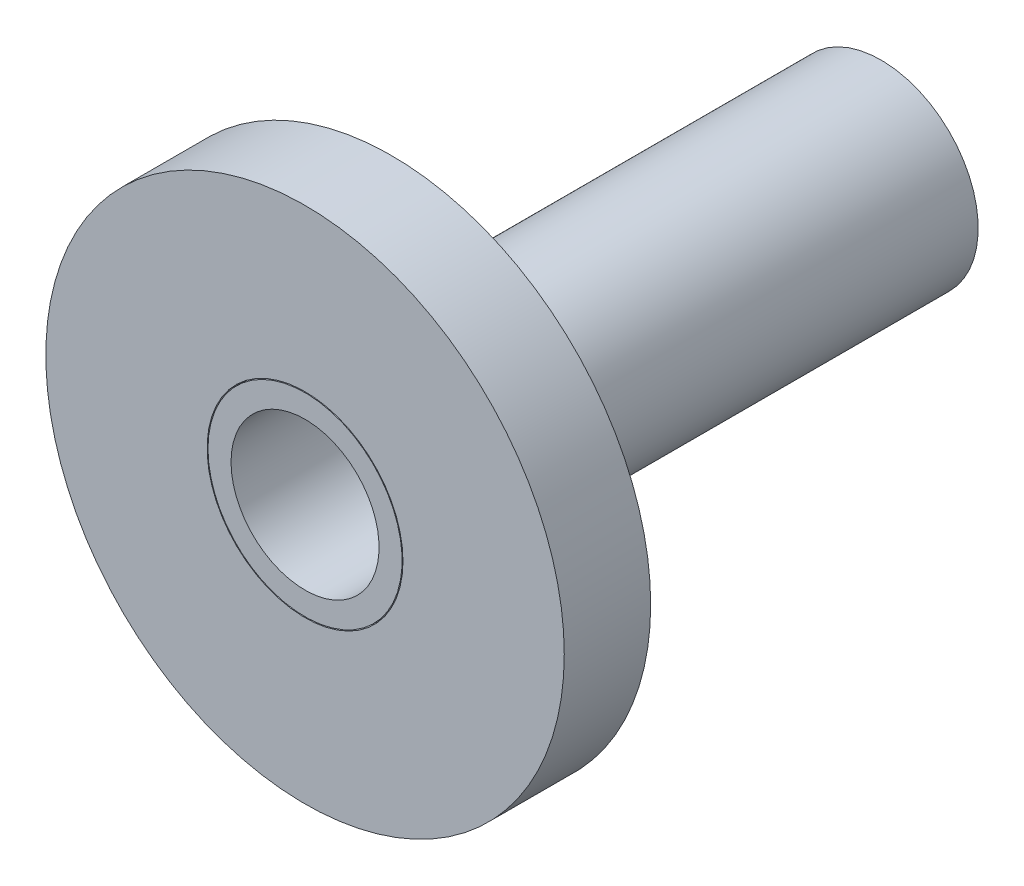
ISO-10303-21;
HEADER;
FILE_DESCRIPTION(('STEP AP214'),'2;1');
FILE_NAME('part.step','',(''),(''),'','','');
FILE_SCHEMA(('AUTOMOTIVE_DESIGN { 1 0 10303 214 1 1 1 1 }'));
ENDSEC;
DATA;
#1=APPLICATION_CONTEXT('core data for automotive mechanical design processes');
#2=APPLICATION_PROTOCOL_DEFINITION('international standard','automotive_design',2000,#1);
#3=PRODUCT_CONTEXT('',#1,'mechanical');
#4=PRODUCT('Part','Part','',(#3));
#5=PRODUCT_RELATED_PRODUCT_CATEGORY('part','',(#4));
#6=PRODUCT_DEFINITION_FORMATION('','',#4);
#7=PRODUCT_DEFINITION_CONTEXT('part definition',#1,'design');
#8=PRODUCT_DEFINITION('design','',#6,#7);
#9=PRODUCT_DEFINITION_SHAPE('','',#8);
#10=(LENGTH_UNIT() NAMED_UNIT(*) SI_UNIT(.MILLI.,.METRE.));
#11=(NAMED_UNIT(*) PLANE_ANGLE_UNIT() SI_UNIT($,.RADIAN.));
#12=(NAMED_UNIT(*) SI_UNIT($,.STERADIAN.) SOLID_ANGLE_UNIT());
#13=UNCERTAINTY_MEASURE_WITH_UNIT(LENGTH_MEASURE(1.E-05),#10,'distance_accuracy_value','');
#14=(GEOMETRIC_REPRESENTATION_CONTEXT(3) GLOBAL_UNCERTAINTY_ASSIGNED_CONTEXT((#13)) GLOBAL_UNIT_ASSIGNED_CONTEXT((#10,
#11,#12)) REPRESENTATION_CONTEXT('',''));
#15=CARTESIAN_POINT('',(0.,0.,0.));
#16=DIRECTION('',(0.,0.,1.));
#17=DIRECTION('',(1.,0.,0.));
#18=AXIS2_PLACEMENT_3D('',#15,#16,#17);
#19=CARTESIAN_POINT('',(0.,0.,-15.));
#20=DIRECTION('',(0.,0.,1.));
#21=DIRECTION('',(1.,0.,0.));
#22=AXIS2_PLACEMENT_3D('',#19,#20,#21);
#23=CYLINDRICAL_SURFACE('',#22,45.);
#24=CARTESIAN_POINT('',(0.,0.,-15.));
#25=DIRECTION('',(0.,0.,1.));
#26=DIRECTION('',(1.,0.,0.));
#27=AXIS2_PLACEMENT_3D('',#24,#25,#26);
#28=CIRCLE('',#27,45.);
#29=CARTESIAN_POINT('',(45.,0.,-15.));
#30=VERTEX_POINT('',#29);
#31=EDGE_CURVE('E14',#30,#30,#28,.T.);
#32=ORIENTED_EDGE('',*,*,#31,.T.);
#33=EDGE_LOOP('',(#32));
#34=FACE_BOUND('',#33,.T.);
#35=CARTESIAN_POINT('',(0.,0.,0.));
#36=DIRECTION('',(0.,0.,1.));
#37=DIRECTION('',(1.,0.,0.));
#38=AXIS2_PLACEMENT_3D('',#35,#36,#37);
#39=CIRCLE('',#38,45.);
#40=CARTESIAN_POINT('',(45.,0.,0.));
#41=VERTEX_POINT('',#40);
#42=EDGE_CURVE('E64',#41,#41,#39,.T.);
#43=ORIENTED_EDGE('',*,*,#42,.F.);
#44=EDGE_LOOP('',(#43));
#45=FACE_BOUND('',#44,.T.);
#46=ADVANCED_FACE('F61',(#34,#45),#23,.T.);
#47=CARTESIAN_POINT('',(0.,0.,-15.));
#48=DIRECTION('',(0.,0.,1.));
#49=DIRECTION('',(1.,0.,0.));
#50=AXIS2_PLACEMENT_3D('',#47,#48,#49);
#51=PLANE('',#50);
#52=CARTESIAN_POINT('',(0.,0.,-15.));
#53=DIRECTION('',(0.,0.,1.));
#54=DIRECTION('',(1.,0.,0.));
#55=AXIS2_PLACEMENT_3D('',#52,#53,#54);
#56=CIRCLE('',#55,17.);
#57=CARTESIAN_POINT('',(17.,0.,-15.));
#58=VERTEX_POINT('',#57);
#59=EDGE_CURVE('E71',#58,#58,#56,.T.);
#60=ORIENTED_EDGE('',*,*,#59,.T.);
#61=EDGE_LOOP('',(#60));
#62=FACE_BOUND('',#61,.T.);
#63=ORIENTED_EDGE('',*,*,#31,.F.);
#64=EDGE_LOOP('',(#63));
#65=FACE_BOUND('',#64,.T.);
#66=ADVANCED_FACE('F79',(#62,#65),#51,.F.);
#67=CARTESIAN_POINT('',(0.,0.,0.));
#68=DIRECTION('',(0.,0.,1.));
#69=DIRECTION('',(1.,0.,0.));
#70=AXIS2_PLACEMENT_3D('',#67,#68,#69);
#71=PLANE('',#70);
#72=CARTESIAN_POINT('',(0.,0.,0.));
#73=DIRECTION('',(0.,0.,1.));
#74=DIRECTION('',(1.,0.,0.));
#75=AXIS2_PLACEMENT_3D('',#72,#73,#74);
#76=CIRCLE('',#75,17.);
#77=CARTESIAN_POINT('',(17.,0.,0.));
#78=VERTEX_POINT('',#77);
#79=EDGE_CURVE('E73',#78,#78,#76,.T.);
#80=ORIENTED_EDGE('',*,*,#79,.F.);
#81=EDGE_LOOP('',(#80));
#82=FACE_BOUND('',#81,.T.);
#83=ORIENTED_EDGE('',*,*,#42,.T.);
#84=EDGE_LOOP('',(#83));
#85=FACE_BOUND('',#84,.T.);
#86=ADVANCED_FACE('F85',(#82,#85),#71,.T.);
#87=CARTESIAN_POINT('',(0.,0.,-15.));
#88=DIRECTION('',(0.,0.,1.));
#89=DIRECTION('',(1.,0.,0.));
#90=AXIS2_PLACEMENT_3D('',#87,#88,#89);
#91=CYLINDRICAL_SURFACE('',#90,17.);
#92=ORIENTED_EDGE('',*,*,#59,.F.);
#93=EDGE_LOOP('',(#92));
#94=FACE_BOUND('',#93,.T.);
#95=ORIENTED_EDGE('',*,*,#79,.T.);
#96=EDGE_LOOP('',(#95));
#97=FACE_BOUND('',#96,.T.);
#98=ADVANCED_FACE('F82',(#94,#97),#91,.F.);
#99=CLOSED_SHELL('',(#46,#66,#86,#98));
#100=MANIFOLD_SOLID_BREP('B2',#99);
#101=CARTESIAN_POINT('',(0.,0.,-100.));
#102=DIRECTION('',(0.,0.,1.));
#103=DIRECTION('',(1.,0.,0.));
#104=AXIS2_PLACEMENT_3D('',#101,#102,#103);
#105=CYLINDRICAL_SURFACE('',#104,12.85);
#106=CARTESIAN_POINT('',(0.,0.,-100.));
#107=DIRECTION('',(0.,0.,-1.));
#108=DIRECTION('',(-1.,0.,0.));
#109=AXIS2_PLACEMENT_3D('',#106,#107,#108);
#110=CIRCLE('',#109,12.85);
#111=CARTESIAN_POINT('',(-12.85,0.,-100.));
#112=VERTEX_POINT('',#111);
#113=EDGE_CURVE('E136',#112,#112,#110,.T.);
#114=ORIENTED_EDGE('',*,*,#113,.T.);
#115=EDGE_LOOP('',(#114));
#116=FACE_BOUND('',#115,.T.);
#117=CARTESIAN_POINT('',(0.,0.,0.));
#118=DIRECTION('',(0.,0.,-1.));
#119=DIRECTION('',(-1.,0.,0.));
#120=AXIS2_PLACEMENT_3D('',#117,#118,#119);
#121=CIRCLE('',#120,12.85);
#122=CARTESIAN_POINT('',(-12.85,0.,0.));
#123=VERTEX_POINT('',#122);
#124=EDGE_CURVE('E142',#123,#123,#121,.T.);
#125=ORIENTED_EDGE('',*,*,#124,.F.);
#126=EDGE_LOOP('',(#125));
#127=FACE_BOUND('',#126,.T.);
#128=ADVANCED_FACE('F129',(#116,#127),#105,.F.);
#129=CARTESIAN_POINT('',(0.,0.,-100.));
#130=DIRECTION('',(0.,0.,1.));
#131=DIRECTION('',(1.,0.,0.));
#132=AXIS2_PLACEMENT_3D('',#129,#130,#131);
#133=CYLINDRICAL_SURFACE('',#132,16.85);
#134=CARTESIAN_POINT('',(0.,0.,-100.));
#135=DIRECTION('',(0.,0.,-1.));
#136=DIRECTION('',(-1.,0.,0.));
#137=AXIS2_PLACEMENT_3D('',#134,#135,#136);
#138=CIRCLE('',#137,16.85);
#139=CARTESIAN_POINT('',(-16.85,0.,-100.));
#140=VERTEX_POINT('',#139);
#141=EDGE_CURVE('E60',#140,#140,#138,.T.);
#142=ORIENTED_EDGE('',*,*,#141,.F.);
#143=EDGE_LOOP('',(#142));
#144=FACE_BOUND('',#143,.T.);
#145=CARTESIAN_POINT('',(0.,0.,0.));
#146=DIRECTION('',(0.,0.,-1.));
#147=DIRECTION('',(-1.,0.,0.));
#148=AXIS2_PLACEMENT_3D('',#145,#146,#147);
#149=CIRCLE('',#148,16.85);
#150=CARTESIAN_POINT('',(-16.85,0.,0.));
#151=VERTEX_POINT('',#150);
#152=EDGE_CURVE('E132',#151,#151,#149,.T.);
#153=ORIENTED_EDGE('',*,*,#152,.T.);
#154=EDGE_LOOP('',(#153));
#155=FACE_BOUND('',#154,.T.);
#156=ADVANCED_FACE('F149',(#144,#155),#133,.T.);
#157=CARTESIAN_POINT('',(0.,0.,-100.));
#158=DIRECTION('',(0.,0.,-1.));
#159=DIRECTION('',(-1.,0.,0.));
#160=AXIS2_PLACEMENT_3D('',#157,#158,#159);
#161=PLANE('',#160);
#162=ORIENTED_EDGE('',*,*,#113,.F.);
#163=EDGE_LOOP('',(#162));
#164=FACE_BOUND('',#163,.T.);
#165=ORIENTED_EDGE('',*,*,#141,.T.);
#166=EDGE_LOOP('',(#165));
#167=FACE_BOUND('',#166,.T.);
#168=ADVANCED_FACE('F153',(#164,#167),#161,.T.);
#169=CARTESIAN_POINT('',(0.,0.,0.));
#170=DIRECTION('',(0.,0.,-1.));
#171=DIRECTION('',(-1.,0.,0.));
#172=AXIS2_PLACEMENT_3D('',#169,#170,#171);
#173=PLANE('',#172);
#174=ORIENTED_EDGE('',*,*,#124,.T.);
#175=EDGE_LOOP('',(#174));
#176=FACE_BOUND('',#175,.T.);
#177=ORIENTED_EDGE('',*,*,#152,.F.);
#178=EDGE_LOOP('',(#177));
#179=FACE_BOUND('',#178,.T.);
#180=ADVANCED_FACE('F151',(#176,#179),#173,.F.);
#181=CLOSED_SHELL('',(#128,#156,#168,#180));
#182=MANIFOLD_SOLID_BREP('B9',#181);
#183=ADVANCED_BREP_SHAPE_REPRESENTATION('',(#18,#100,#182),#14);
#184=SHAPE_DEFINITION_REPRESENTATION(#9,#183);
ENDSEC;
END-ISO-10303-21;
